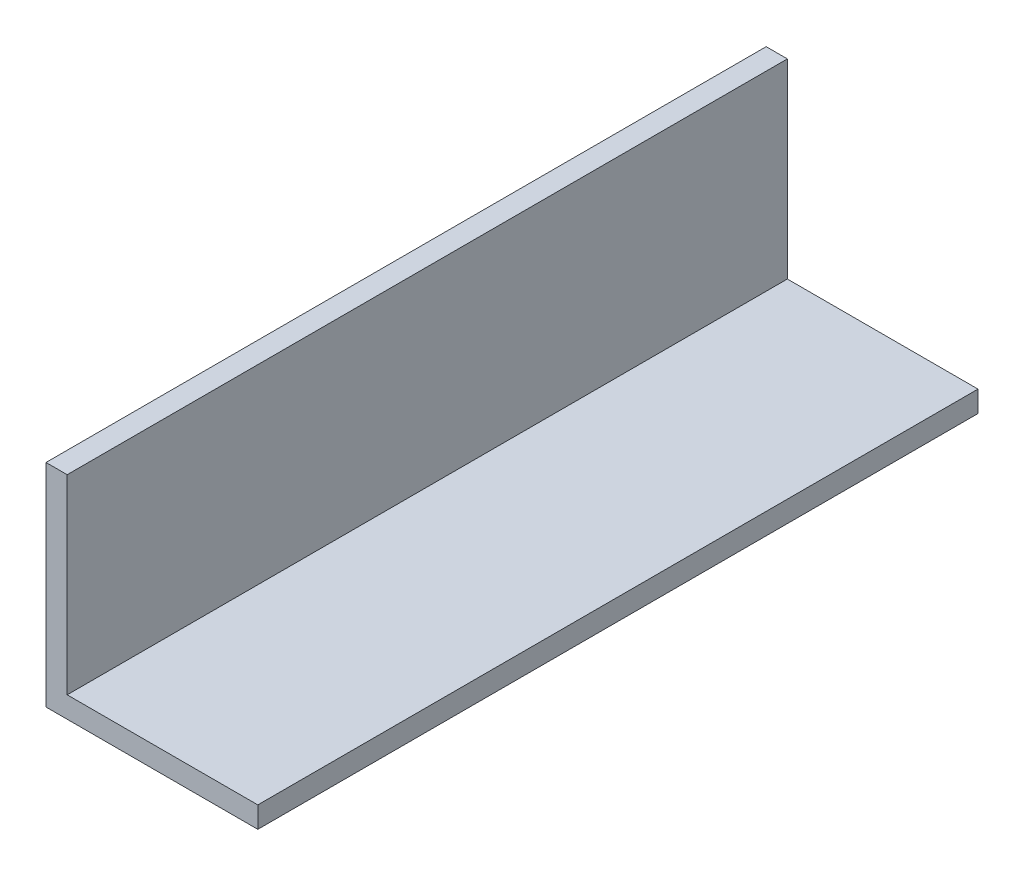
ISO-10303-21;
HEADER;
FILE_DESCRIPTION(('STEP AP214'),'2;1');
FILE_NAME('part.step','',(''),(''),'','','');
FILE_SCHEMA(('AUTOMOTIVE_DESIGN { 1 0 10303 214 1 1 1 1 }'));
ENDSEC;
DATA;
#1=APPLICATION_CONTEXT('core data for automotive mechanical design processes');
#2=APPLICATION_PROTOCOL_DEFINITION('international standard','automotive_design',2000,#1);
#3=PRODUCT_CONTEXT('',#1,'mechanical');
#4=PRODUCT('Part','Part','',(#3));
#5=PRODUCT_RELATED_PRODUCT_CATEGORY('part','',(#4));
#6=PRODUCT_DEFINITION_FORMATION('','',#4);
#7=PRODUCT_DEFINITION_CONTEXT('part definition',#1,'design');
#8=PRODUCT_DEFINITION('design','',#6,#7);
#9=PRODUCT_DEFINITION_SHAPE('','',#8);
#10=(LENGTH_UNIT() NAMED_UNIT(*) SI_UNIT(.MILLI.,.METRE.));
#11=(NAMED_UNIT(*) PLANE_ANGLE_UNIT() SI_UNIT($,.RADIAN.));
#12=(NAMED_UNIT(*) SI_UNIT($,.STERADIAN.) SOLID_ANGLE_UNIT());
#13=UNCERTAINTY_MEASURE_WITH_UNIT(LENGTH_MEASURE(1.E-05),#10,'distance_accuracy_value','');
#14=(GEOMETRIC_REPRESENTATION_CONTEXT(3) GLOBAL_UNCERTAINTY_ASSIGNED_CONTEXT((#13)) GLOBAL_UNIT_ASSIGNED_CONTEXT((#10,
#11,#12)) REPRESENTATION_CONTEXT('',''));
#15=CARTESIAN_POINT('',(0.,0.,0.));
#16=DIRECTION('',(0.,0.,1.));
#17=DIRECTION('',(1.,0.,0.));
#18=AXIS2_PLACEMENT_3D('',#15,#16,#17);
#19=CARTESIAN_POINT('',(0.,20.,68.));
#20=DIRECTION('',(1.,0.,0.));
#21=DIRECTION('',(0.,1.,0.));
#22=AXIS2_PLACEMENT_3D('',#19,#20,#21);
#23=PLANE('',#22);
#24=DIRECTION('',(0.,-1.,0.));
#25=VECTOR('',#24,1.);
#26=CARTESIAN_POINT('',(0.,20.,0.));
#27=LINE('',#26,#25);
#28=CARTESIAN_POINT('',(0.,20.,0.));
#29=VERTEX_POINT('',#28);
#30=CARTESIAN_POINT('',(0.,0.,0.));
#31=VERTEX_POINT('',#30);
#32=EDGE_CURVE('E120',#29,#31,#27,.T.);
#33=ORIENTED_EDGE('',*,*,#32,.T.);
#34=DIRECTION('',(0.,0.,-1.));
#35=VECTOR('',#34,1.);
#36=CARTESIAN_POINT('',(0.,0.,68.));
#37=LINE('',#36,#35);
#38=CARTESIAN_POINT('',(0.,0.,68.));
#39=VERTEX_POINT('',#38);
#40=EDGE_CURVE('E11',#39,#31,#37,.T.);
#41=ORIENTED_EDGE('',*,*,#40,.F.);
#42=DIRECTION('',(0.,-1.,0.));
#43=VECTOR('',#42,1.);
#44=CARTESIAN_POINT('',(0.,20.,68.));
#45=LINE('',#44,#43);
#46=CARTESIAN_POINT('',(0.,20.,68.));
#47=VERTEX_POINT('',#46);
#48=EDGE_CURVE('E130',#47,#39,#45,.T.);
#49=ORIENTED_EDGE('',*,*,#48,.F.);
#50=DIRECTION('',(0.,0.,-1.));
#51=VECTOR('',#50,1.);
#52=CARTESIAN_POINT('',(0.,20.,68.));
#53=LINE('',#52,#51);
#54=EDGE_CURVE('E116',#47,#29,#53,.T.);
#55=ORIENTED_EDGE('',*,*,#54,.T.);
#56=EDGE_LOOP('',(#33,#41,#49,#55));
#57=FACE_BOUND('',#56,.T.);
#58=ADVANCED_FACE('F36',(#57),#23,.F.);
#59=CARTESIAN_POINT('',(0.,0.,68.));
#60=DIRECTION('',(0.,1.,0.));
#61=DIRECTION('',(0.,0.,1.));
#62=AXIS2_PLACEMENT_3D('',#59,#60,#61);
#63=PLANE('',#62);
#64=DIRECTION('',(1.,0.,0.));
#65=VECTOR('',#64,1.);
#66=CARTESIAN_POINT('',(0.,0.,0.));
#67=LINE('',#66,#65);
#68=CARTESIAN_POINT('',(20.,0.,0.));
#69=VERTEX_POINT('',#68);
#70=EDGE_CURVE('E123',#31,#69,#67,.T.);
#71=ORIENTED_EDGE('',*,*,#70,.T.);
#72=DIRECTION('',(0.,0.,-1.));
#73=VECTOR('',#72,1.);
#74=CARTESIAN_POINT('',(20.,0.,68.));
#75=LINE('',#74,#73);
#76=CARTESIAN_POINT('',(20.,0.,68.));
#77=VERTEX_POINT('',#76);
#78=EDGE_CURVE('E44',#77,#69,#75,.T.);
#79=ORIENTED_EDGE('',*,*,#78,.F.);
#80=DIRECTION('',(1.,0.,0.));
#81=VECTOR('',#80,1.);
#82=CARTESIAN_POINT('',(0.,0.,68.));
#83=LINE('',#82,#81);
#84=EDGE_CURVE('E89',#39,#77,#83,.T.);
#85=ORIENTED_EDGE('',*,*,#84,.F.);
#86=ORIENTED_EDGE('',*,*,#40,.T.);
#87=EDGE_LOOP('',(#71,#79,#85,#86));
#88=FACE_BOUND('',#87,.T.);
#89=ADVANCED_FACE('F154',(#88),#63,.F.);
#90=CARTESIAN_POINT('',(20.,2.,68.));
#91=DIRECTION('',(-1.,0.,0.));
#92=DIRECTION('',(0.,0.,1.));
#93=AXIS2_PLACEMENT_3D('',#90,#91,#92);
#94=PLANE('',#93);
#95=DIRECTION('',(0.,1.,0.));
#96=VECTOR('',#95,1.);
#97=CARTESIAN_POINT('',(20.,2.,0.));
#98=LINE('',#97,#96);
#99=CARTESIAN_POINT('',(20.,2.,0.));
#100=VERTEX_POINT('',#99);
#101=EDGE_CURVE('E125',#69,#100,#98,.T.);
#102=ORIENTED_EDGE('',*,*,#101,.T.);
#103=DIRECTION('',(0.,0.,-1.));
#104=VECTOR('',#103,1.);
#105=CARTESIAN_POINT('',(20.,2.,68.));
#106=LINE('',#105,#104);
#107=CARTESIAN_POINT('',(20.,2.,68.));
#108=VERTEX_POINT('',#107);
#109=EDGE_CURVE('E111',#108,#100,#106,.T.);
#110=ORIENTED_EDGE('',*,*,#109,.F.);
#111=DIRECTION('',(0.,1.,0.));
#112=VECTOR('',#111,1.);
#113=CARTESIAN_POINT('',(20.,2.,68.));
#114=LINE('',#113,#112);
#115=EDGE_CURVE('E102',#77,#108,#114,.T.);
#116=ORIENTED_EDGE('',*,*,#115,.F.);
#117=ORIENTED_EDGE('',*,*,#78,.T.);
#118=EDGE_LOOP('',(#102,#110,#116,#117));
#119=FACE_BOUND('',#118,.T.);
#120=ADVANCED_FACE('F136',(#119),#94,.F.);
#121=CARTESIAN_POINT('',(2.,2.,68.));
#122=DIRECTION('',(0.,-1.,0.));
#123=DIRECTION('',(0.,0.,-1.));
#124=AXIS2_PLACEMENT_3D('',#121,#122,#123);
#125=PLANE('',#124);
#126=DIRECTION('',(-1.,0.,0.));
#127=VECTOR('',#126,1.);
#128=CARTESIAN_POINT('',(2.,2.,0.));
#129=LINE('',#128,#127);
#130=CARTESIAN_POINT('',(2.,2.,0.));
#131=VERTEX_POINT('',#130);
#132=EDGE_CURVE('E110',#100,#131,#129,.T.);
#133=ORIENTED_EDGE('',*,*,#132,.T.);
#134=DIRECTION('',(0.,0.,-1.));
#135=VECTOR('',#134,1.);
#136=CARTESIAN_POINT('',(2.,2.,68.));
#137=LINE('',#136,#135);
#138=CARTESIAN_POINT('',(2.,2.,68.));
#139=VERTEX_POINT('',#138);
#140=EDGE_CURVE('E107',#139,#131,#137,.T.);
#141=ORIENTED_EDGE('',*,*,#140,.F.);
#142=DIRECTION('',(-1.,0.,0.));
#143=VECTOR('',#142,1.);
#144=CARTESIAN_POINT('',(2.,2.,68.));
#145=LINE('',#144,#143);
#146=EDGE_CURVE('E96',#108,#139,#145,.T.);
#147=ORIENTED_EDGE('',*,*,#146,.F.);
#148=ORIENTED_EDGE('',*,*,#109,.T.);
#149=EDGE_LOOP('',(#133,#141,#147,#148));
#150=FACE_BOUND('',#149,.T.);
#151=ADVANCED_FACE('F108',(#150),#125,.F.);
#152=CARTESIAN_POINT('',(2.,20.,68.));
#153=DIRECTION('',(-1.,0.,0.));
#154=DIRECTION('',(0.,-1.,0.));
#155=AXIS2_PLACEMENT_3D('',#152,#153,#154);
#156=PLANE('',#155);
#157=DIRECTION('',(0.,1.,0.));
#158=VECTOR('',#157,1.);
#159=CARTESIAN_POINT('',(2.,20.,0.));
#160=LINE('',#159,#158);
#161=CARTESIAN_POINT('',(2.,20.,0.));
#162=VERTEX_POINT('',#161);
#163=EDGE_CURVE('E75',#131,#162,#160,.T.);
#164=ORIENTED_EDGE('',*,*,#163,.T.);
#165=DIRECTION('',(0.,0.,-1.));
#166=VECTOR('',#165,1.);
#167=CARTESIAN_POINT('',(2.,20.,68.));
#168=LINE('',#167,#166);
#169=CARTESIAN_POINT('',(2.,20.,68.));
#170=VERTEX_POINT('',#169);
#171=EDGE_CURVE('E112',#170,#162,#168,.T.);
#172=ORIENTED_EDGE('',*,*,#171,.F.);
#173=DIRECTION('',(0.,1.,0.));
#174=VECTOR('',#173,1.);
#175=CARTESIAN_POINT('',(2.,20.,68.));
#176=LINE('',#175,#174);
#177=EDGE_CURVE('E100',#139,#170,#176,.T.);
#178=ORIENTED_EDGE('',*,*,#177,.F.);
#179=ORIENTED_EDGE('',*,*,#140,.T.);
#180=EDGE_LOOP('',(#164,#172,#178,#179));
#181=FACE_BOUND('',#180,.T.);
#182=ADVANCED_FACE('F114',(#181),#156,.F.);
#183=CARTESIAN_POINT('',(2.,20.,68.));
#184=DIRECTION('',(0.,-1.,0.));
#185=DIRECTION('',(0.,0.,-1.));
#186=AXIS2_PLACEMENT_3D('',#183,#184,#185);
#187=PLANE('',#186);
#188=DIRECTION('',(-1.,0.,0.));
#189=VECTOR('',#188,1.);
#190=CARTESIAN_POINT('',(2.,20.,0.));
#191=LINE('',#190,#189);
#192=EDGE_CURVE('E81',#162,#29,#191,.T.);
#193=ORIENTED_EDGE('',*,*,#192,.T.);
#194=ORIENTED_EDGE('',*,*,#54,.F.);
#195=DIRECTION('',(-1.,0.,0.));
#196=VECTOR('',#195,1.);
#197=CARTESIAN_POINT('',(2.,20.,68.));
#198=LINE('',#197,#196);
#199=EDGE_CURVE('E52',#170,#47,#198,.T.);
#200=ORIENTED_EDGE('',*,*,#199,.F.);
#201=ORIENTED_EDGE('',*,*,#171,.T.);
#202=EDGE_LOOP('',(#193,#194,#200,#201));
#203=FACE_BOUND('',#202,.T.);
#204=ADVANCED_FACE('F143',(#203),#187,.F.);
#205=CARTESIAN_POINT('',(0.,0.,68.));
#206=DIRECTION('',(0.,0.,1.));
#207=DIRECTION('',(1.,0.,0.));
#208=AXIS2_PLACEMENT_3D('',#205,#206,#207);
#209=PLANE('',#208);
#210=ORIENTED_EDGE('',*,*,#48,.T.);
#211=ORIENTED_EDGE('',*,*,#84,.T.);
#212=ORIENTED_EDGE('',*,*,#115,.T.);
#213=ORIENTED_EDGE('',*,*,#146,.T.);
#214=ORIENTED_EDGE('',*,*,#177,.T.);
#215=ORIENTED_EDGE('',*,*,#199,.T.);
#216=EDGE_LOOP('',(#210,#211,#212,#213,#214,#215));
#217=FACE_BOUND('',#216,.T.);
#218=ADVANCED_FACE('F98',(#217),#209,.T.);
#219=CARTESIAN_POINT('',(0.,0.,0.));
#220=DIRECTION('',(0.,0.,1.));
#221=DIRECTION('',(1.,0.,0.));
#222=AXIS2_PLACEMENT_3D('',#219,#220,#221);
#223=PLANE('',#222);
#224=ORIENTED_EDGE('',*,*,#32,.F.);
#225=ORIENTED_EDGE('',*,*,#192,.F.);
#226=ORIENTED_EDGE('',*,*,#163,.F.);
#227=ORIENTED_EDGE('',*,*,#132,.F.);
#228=ORIENTED_EDGE('',*,*,#101,.F.);
#229=ORIENTED_EDGE('',*,*,#70,.F.);
#230=EDGE_LOOP('',(#224,#225,#226,#227,#228,#229));
#231=FACE_BOUND('',#230,.T.);
#232=ADVANCED_FACE('F139',(#231),#223,.F.);
#233=CLOSED_SHELL('',(#58,#89,#120,#151,#182,#204,#218,#232));
#234=MANIFOLD_SOLID_BREP('B2',#233);
#235=ADVANCED_BREP_SHAPE_REPRESENTATION('',(#18,#234),#14);
#236=SHAPE_DEFINITION_REPRESENTATION(#9,#235);
ENDSEC;
END-ISO-10303-21;
